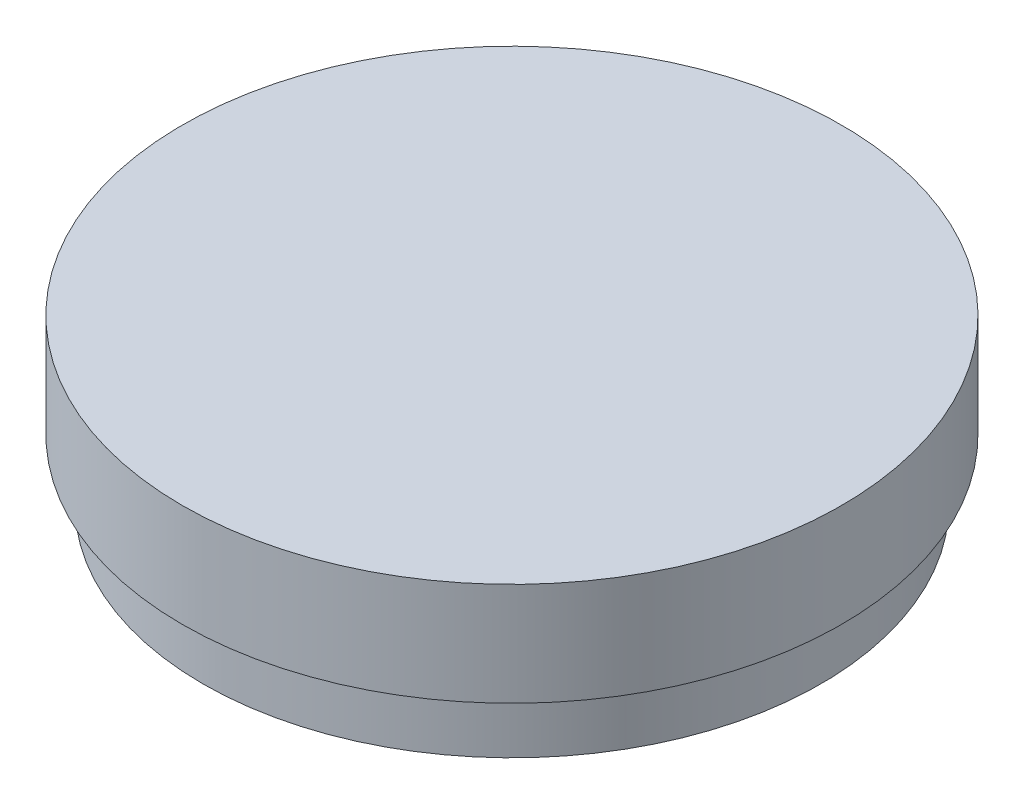
ISO-10303-21;
HEADER;
FILE_DESCRIPTION(('STEP AP214'),'2;1');
FILE_NAME('part.step','',(''),(''),'','','');
FILE_SCHEMA(('AUTOMOTIVE_DESIGN { 1 0 10303 214 1 1 1 1 }'));
ENDSEC;
DATA;
#1=APPLICATION_CONTEXT('core data for automotive mechanical design processes');
#2=APPLICATION_PROTOCOL_DEFINITION('international standard','automotive_design',2000,#1);
#3=PRODUCT_CONTEXT('',#1,'mechanical');
#4=PRODUCT('Part','Part','',(#3));
#5=PRODUCT_RELATED_PRODUCT_CATEGORY('part','',(#4));
#6=PRODUCT_DEFINITION_FORMATION('','',#4);
#7=PRODUCT_DEFINITION_CONTEXT('part definition',#1,'design');
#8=PRODUCT_DEFINITION('design','',#6,#7);
#9=PRODUCT_DEFINITION_SHAPE('','',#8);
#10=(LENGTH_UNIT() NAMED_UNIT(*) SI_UNIT(.MILLI.,.METRE.));
#11=(NAMED_UNIT(*) PLANE_ANGLE_UNIT() SI_UNIT($,.RADIAN.));
#12=(NAMED_UNIT(*) SI_UNIT($,.STERADIAN.) SOLID_ANGLE_UNIT());
#13=UNCERTAINTY_MEASURE_WITH_UNIT(LENGTH_MEASURE(1.E-05),#10,'distance_accuracy_value','');
#14=(GEOMETRIC_REPRESENTATION_CONTEXT(3) GLOBAL_UNCERTAINTY_ASSIGNED_CONTEXT((#13)) GLOBAL_UNIT_ASSIGNED_CONTEXT((#10,
#11,#12)) REPRESENTATION_CONTEXT('',''));
#15=CARTESIAN_POINT('',(0.,0.,0.));
#16=DIRECTION('',(0.,0.,1.));
#17=DIRECTION('',(1.,0.,0.));
#18=AXIS2_PLACEMENT_3D('',#15,#16,#17);
#19=CARTESIAN_POINT('',(0.,3.,0.));
#20=DIRECTION('',(0.,-1.,0.));
#21=DIRECTION('',(0.,0.,-1.));
#22=AXIS2_PLACEMENT_3D('',#19,#20,#21);
#23=CYLINDRICAL_SURFACE('',#22,15.0000000000006);
#24=CARTESIAN_POINT('',(0.,3.,0.));
#25=DIRECTION('',(0.,1.,0.));
#26=DIRECTION('',(0.,0.,1.));
#27=AXIS2_PLACEMENT_3D('',#24,#25,#26);
#28=CIRCLE('',#27,15.0000000000006);
#29=CARTESIAN_POINT('',(0.,3.,15.0000000000006));
#30=VERTEX_POINT('',#29);
#31=EDGE_CURVE('E10',#30,#30,#28,.T.);
#32=ORIENTED_EDGE('',*,*,#31,.F.);
#33=EDGE_LOOP('',(#32));
#34=FACE_BOUND('',#33,.T.);
#35=CARTESIAN_POINT('',(0.,0.,0.));
#36=DIRECTION('',(0.,1.,0.));
#37=DIRECTION('',(0.,0.,1.));
#38=AXIS2_PLACEMENT_3D('',#35,#36,#37);
#39=CIRCLE('',#38,15.0000000000006);
#40=CARTESIAN_POINT('',(0.,0.,15.0000000000006));
#41=VERTEX_POINT('',#40);
#42=EDGE_CURVE('E36',#41,#41,#39,.T.);
#43=ORIENTED_EDGE('',*,*,#42,.T.);
#44=EDGE_LOOP('',(#43));
#45=FACE_BOUND('',#44,.T.);
#46=ADVANCED_FACE('F33',(#34,#45),#23,.T.);
#47=CARTESIAN_POINT('',(0.,0.,0.));
#48=DIRECTION('',(0.,1.,0.));
#49=DIRECTION('',(0.,0.,1.));
#50=AXIS2_PLACEMENT_3D('',#47,#48,#49);
#51=PLANE('',#50);
#52=ORIENTED_EDGE('',*,*,#42,.F.);
#53=EDGE_LOOP('',(#52));
#54=FACE_BOUND('',#53,.T.);
#55=ADVANCED_FACE('F56',(#54),#51,.F.);
#56=CARTESIAN_POINT('',(0.,8.,0.));
#57=DIRECTION('',(0.,-1.,0.));
#58=DIRECTION('',(0.,0.,-1.));
#59=AXIS2_PLACEMENT_3D('',#56,#57,#58);
#60=CYLINDRICAL_SURFACE('',#59,16.0000000000006);
#61=CARTESIAN_POINT('',(0.,8.,0.));
#62=DIRECTION('',(0.,1.,0.));
#63=DIRECTION('',(0.,0.,1.));
#64=AXIS2_PLACEMENT_3D('',#61,#62,#63);
#65=CIRCLE('',#64,16.0000000000006);
#66=CARTESIAN_POINT('',(0.,8.,16.0000000000006));
#67=VERTEX_POINT('',#66);
#68=EDGE_CURVE('E43',#67,#67,#65,.T.);
#69=ORIENTED_EDGE('',*,*,#68,.F.);
#70=EDGE_LOOP('',(#69));
#71=FACE_BOUND('',#70,.T.);
#72=CARTESIAN_POINT('',(0.,3.,0.));
#73=DIRECTION('',(0.,1.,0.));
#74=DIRECTION('',(0.,0.,1.));
#75=AXIS2_PLACEMENT_3D('',#72,#73,#74);
#76=CIRCLE('',#75,16.0000000000006);
#77=CARTESIAN_POINT('',(0.,3.,16.0000000000006));
#78=VERTEX_POINT('',#77);
#79=EDGE_CURVE('E45',#78,#78,#76,.T.);
#80=ORIENTED_EDGE('',*,*,#79,.T.);
#81=EDGE_LOOP('',(#80));
#82=FACE_BOUND('',#81,.T.);
#83=ADVANCED_FACE('F53',(#71,#82),#60,.T.);
#84=CARTESIAN_POINT('',(0.,8.,0.));
#85=DIRECTION('',(0.,1.,0.));
#86=DIRECTION('',(0.,0.,1.));
#87=AXIS2_PLACEMENT_3D('',#84,#85,#86);
#88=PLANE('',#87);
#89=ORIENTED_EDGE('',*,*,#68,.T.);
#90=EDGE_LOOP('',(#89));
#91=FACE_BOUND('',#90,.T.);
#92=ADVANCED_FACE('F51',(#91),#88,.T.);
#93=CARTESIAN_POINT('',(0.,3.,0.));
#94=DIRECTION('',(0.,1.,0.));
#95=DIRECTION('',(0.,0.,1.));
#96=AXIS2_PLACEMENT_3D('',#93,#94,#95);
#97=PLANE('',#96);
#98=ORIENTED_EDGE('',*,*,#31,.T.);
#99=EDGE_LOOP('',(#98));
#100=FACE_BOUND('',#99,.T.);
#101=ORIENTED_EDGE('',*,*,#79,.F.);
#102=EDGE_LOOP('',(#101));
#103=FACE_BOUND('',#102,.T.);
#104=ADVANCED_FACE('F60',(#100,#103),#97,.F.);
#105=CLOSED_SHELL('',(#46,#55,#83,#92,#104));
#106=MANIFOLD_SOLID_BREP('B2',#105);
#107=ADVANCED_BREP_SHAPE_REPRESENTATION('',(#18,#106),#14);
#108=SHAPE_DEFINITION_REPRESENTATION(#9,#107);
ENDSEC;
END-ISO-10303-21;
